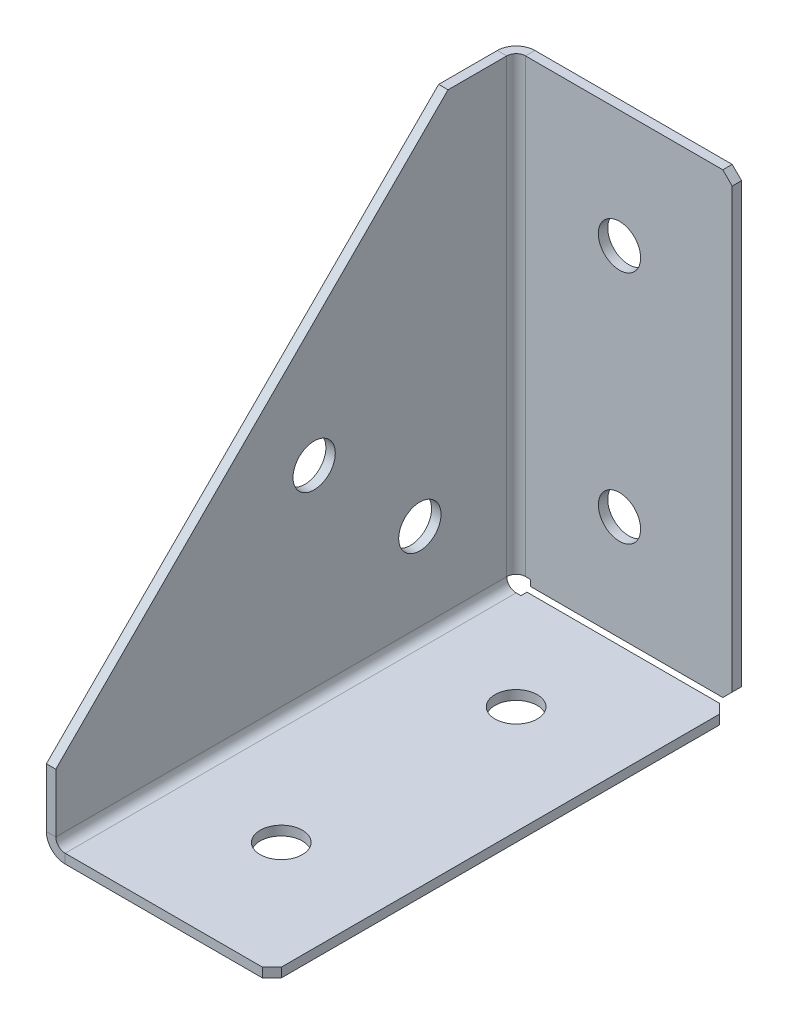
ISO-10303-21;
HEADER;
FILE_DESCRIPTION(('STEP AP214'),'2;1');
FILE_NAME('part.step','',(''),(''),'','','');
FILE_SCHEMA(('AUTOMOTIVE_DESIGN { 1 0 10303 214 1 1 1 1 }'));
ENDSEC;
DATA;
#1=APPLICATION_CONTEXT('core data for automotive mechanical design processes');
#2=APPLICATION_PROTOCOL_DEFINITION('international standard','automotive_design',2000,#1);
#3=PRODUCT_CONTEXT('',#1,'mechanical');
#4=PRODUCT('Part','Part','',(#3));
#5=PRODUCT_RELATED_PRODUCT_CATEGORY('part','',(#4));
#6=PRODUCT_DEFINITION_FORMATION('','',#4);
#7=PRODUCT_DEFINITION_CONTEXT('part definition',#1,'design');
#8=PRODUCT_DEFINITION('design','',#6,#7);
#9=PRODUCT_DEFINITION_SHAPE('','',#8);
#10=(LENGTH_UNIT() NAMED_UNIT(*) SI_UNIT(.MILLI.,.METRE.));
#11=(NAMED_UNIT(*) PLANE_ANGLE_UNIT() SI_UNIT($,.RADIAN.));
#12=(NAMED_UNIT(*) SI_UNIT($,.STERADIAN.) SOLID_ANGLE_UNIT());
#13=UNCERTAINTY_MEASURE_WITH_UNIT(LENGTH_MEASURE(1.E-05),#10,'distance_accuracy_value','');
#14=(GEOMETRIC_REPRESENTATION_CONTEXT(3) GLOBAL_UNCERTAINTY_ASSIGNED_CONTEXT((#13)) GLOBAL_UNIT_ASSIGNED_CONTEXT((#10,
#11,#12)) REPRESENTATION_CONTEXT('',''));
#15=CARTESIAN_POINT('',(0.,0.,0.));
#16=DIRECTION('',(0.,0.,1.));
#17=DIRECTION('',(1.,0.,0.));
#18=AXIS2_PLACEMENT_3D('',#15,#16,#17);
#19=CARTESIAN_POINT('',(4.,4.,3.99999999999998));
#20=DIRECTION('',(0.,0.,1.));
#21=DIRECTION('',(1.,0.,0.));
#22=AXIS2_PLACEMENT_3D('',#19,#20,#21);
#23=PLANE('',#22);
#24=DIRECTION('',(-1.,0.,0.));
#25=VECTOR('',#24,1.);
#26=CARTESIAN_POINT('',(0.,3.99999999999997,3.99999999999997));
#27=LINE('',#26,#25);
#28=CARTESIAN_POINT('',(2.,3.99999999999997,3.99999999999999));
#29=VERTEX_POINT('',#28);
#30=CARTESIAN_POINT('',(0.,3.99999999999997,3.99999999999997));
#31=VERTEX_POINT('',#30);
#32=EDGE_CURVE('E403',#29,#31,#27,.T.);
#33=ORIENTED_EDGE('',*,*,#32,.F.);
#34=CARTESIAN_POINT('',(4.,4.,3.99999999999998));
#35=DIRECTION('',(0.,0.,-1.));
#36=DIRECTION('',(-1.,0.,0.));
#37=AXIS2_PLACEMENT_3D('',#34,#35,#36);
#38=CIRCLE('',#37,2.);
#39=CARTESIAN_POINT('',(4.,2.,3.99999999999998));
#40=VERTEX_POINT('',#39);
#41=EDGE_CURVE('E348',#29,#40,#38,.F.);
#42=ORIENTED_EDGE('',*,*,#41,.T.);
#43=DIRECTION('',(0.,-1.,0.));
#44=VECTOR('',#43,1.);
#45=CARTESIAN_POINT('',(4.,0.,3.99999999999998));
#46=LINE('',#45,#44);
#47=CARTESIAN_POINT('',(4.,0.,3.99999999999998));
#48=VERTEX_POINT('',#47);
#49=EDGE_CURVE('E400',#40,#48,#46,.T.);
#50=ORIENTED_EDGE('',*,*,#49,.T.);
#51=CARTESIAN_POINT('',(4.,4.,3.99999999999998));
#52=DIRECTION('',(0.,0.,-1.));
#53=DIRECTION('',(-1.,0.,0.));
#54=AXIS2_PLACEMENT_3D('',#51,#52,#53);
#55=CIRCLE('',#54,4.);
#56=EDGE_CURVE('E287',#31,#48,#55,.F.);
#57=ORIENTED_EDGE('',*,*,#56,.F.);
#58=EDGE_LOOP('',(#33,#42,#50,#57));
#59=FACE_BOUND('',#58,.T.);
#60=ADVANCED_FACE('F50',(#59),#23,.F.);
#61=CARTESIAN_POINT('',(48.,0.,3.99999999999998));
#62=DIRECTION('',(0.,0.,1.));
#63=DIRECTION('',(1.,0.,0.));
#64=AXIS2_PLACEMENT_3D('',#61,#62,#63);
#65=PLANE('',#64);
#66=ORIENTED_EDGE('',*,*,#49,.F.);
#67=DIRECTION('',(1.,0.,0.));
#68=VECTOR('',#67,1.);
#69=CARTESIAN_POINT('',(48.,2.,3.99999999999998));
#70=LINE('',#69,#68);
#71=CARTESIAN_POINT('',(5.010401,2.,3.99999999999998));
#72=VERTEX_POINT('',#71);
#73=EDGE_CURVE('E318',#40,#72,#70,.T.);
#74=ORIENTED_EDGE('',*,*,#73,.T.);
#75=DIRECTION('',(0.,-1.,0.));
#76=VECTOR('',#75,1.);
#77=CARTESIAN_POINT('',(5.010401,0.,3.99999999999998));
#78=LINE('',#77,#76);
#79=CARTESIAN_POINT('',(5.010401,0.,3.99999999999998));
#80=VERTEX_POINT('',#79);
#81=EDGE_CURVE('E397',#72,#80,#78,.T.);
#82=ORIENTED_EDGE('',*,*,#81,.T.);
#83=DIRECTION('',(1.,0.,0.));
#84=VECTOR('',#83,1.);
#85=CARTESIAN_POINT('',(48.,0.,3.99999999999998));
#86=LINE('',#85,#84);
#87=EDGE_CURVE('E251',#48,#80,#86,.T.);
#88=ORIENTED_EDGE('',*,*,#87,.F.);
#89=EDGE_LOOP('',(#66,#74,#82,#88));
#90=FACE_BOUND('',#89,.T.);
#91=ADVANCED_FACE('F520',(#90),#65,.F.);
#92=CARTESIAN_POINT('',(5.010401,0.,100.));
#93=DIRECTION('',(-1.,0.,0.));
#94=DIRECTION('',(0.,0.,1.));
#95=AXIS2_PLACEMENT_3D('',#92,#93,#94);
#96=PLANE('',#95);
#97=ORIENTED_EDGE('',*,*,#81,.F.);
#98=DIRECTION('',(0.,0.,1.));
#99=VECTOR('',#98,1.);
#100=CARTESIAN_POINT('',(5.010401,2.,100.));
#101=LINE('',#100,#99);
#102=CARTESIAN_POINT('',(5.010401,2.,2.70710678118655));
#103=VERTEX_POINT('',#102);
#104=EDGE_CURVE('E358',#103,#72,#101,.T.);
#105=ORIENTED_EDGE('',*,*,#104,.F.);
#106=DIRECTION('',(0.,-1.,0.));
#107=VECTOR('',#106,1.);
#108=CARTESIAN_POINT('',(5.010401,0.,2.70710678118655));
#109=LINE('',#108,#107);
#110=CARTESIAN_POINT('',(5.010401,0.,2.70710678118655));
#111=VERTEX_POINT('',#110);
#112=EDGE_CURVE('E394',#103,#111,#109,.T.);
#113=ORIENTED_EDGE('',*,*,#112,.T.);
#114=DIRECTION('',(0.,0.,1.));
#115=VECTOR('',#114,1.);
#116=CARTESIAN_POINT('',(5.010401,0.,100.));
#117=LINE('',#116,#115);
#118=EDGE_CURVE('E247',#111,#80,#117,.T.);
#119=ORIENTED_EDGE('',*,*,#118,.T.);
#120=EDGE_LOOP('',(#97,#105,#113,#119));
#121=FACE_BOUND('',#120,.T.);
#122=ADVANCED_FACE('F525',(#121),#96,.T.);
#123=CARTESIAN_POINT('',(48.,0.,2.70710678118655));
#124=DIRECTION('',(0.,0.,1.));
#125=DIRECTION('',(1.,0.,0.));
#126=AXIS2_PLACEMENT_3D('',#123,#124,#125);
#127=PLANE('',#126);
#128=DIRECTION('',(1.,0.,0.));
#129=VECTOR('',#128,1.);
#130=CARTESIAN_POINT('',(48.,2.,2.70710678118655));
#131=LINE('',#130,#129);
#132=CARTESIAN_POINT('',(46.,2.,2.70710678118655));
#133=VERTEX_POINT('',#132);
#134=EDGE_CURVE('E322',#103,#133,#131,.T.);
#135=ORIENTED_EDGE('',*,*,#134,.T.);
#136=DIRECTION('',(0.,1.,0.));
#137=VECTOR('',#136,1.);
#138=CARTESIAN_POINT('',(46.,0.,2.70710678118655));
#139=LINE('',#138,#137);
#140=CARTESIAN_POINT('',(46.,0.,2.70710678118655));
#141=VERTEX_POINT('',#140);
#142=EDGE_CURVE('E430',#133,#141,#139,.F.);
#143=ORIENTED_EDGE('',*,*,#142,.T.);
#144=DIRECTION('',(1.,0.,0.));
#145=VECTOR('',#144,1.);
#146=CARTESIAN_POINT('',(48.,0.,2.70710678118655));
#147=LINE('',#146,#145);
#148=EDGE_CURVE('E243',#111,#141,#147,.T.);
#149=ORIENTED_EDGE('',*,*,#148,.F.);
#150=ORIENTED_EDGE('',*,*,#112,.F.);
#151=EDGE_LOOP('',(#135,#143,#149,#150));
#152=FACE_BOUND('',#151,.T.);
#153=ADVANCED_FACE('F562',(#152),#127,.F.);
#154=CARTESIAN_POINT('',(48.,0.,100.));
#155=DIRECTION('',(1.,0.,0.));
#156=DIRECTION('',(0.,0.,-1.));
#157=AXIS2_PLACEMENT_3D('',#154,#155,#156);
#158=PLANE('',#157);
#159=DIRECTION('',(0.,0.,1.));
#160=VECTOR('',#159,1.);
#161=CARTESIAN_POINT('',(48.,2.,100.));
#162=LINE('',#161,#160);
#163=CARTESIAN_POINT('',(48.,2.,98.));
#164=VERTEX_POINT('',#163);
#165=CARTESIAN_POINT('',(48.,2.,4.70710678118655));
#166=VERTEX_POINT('',#165);
#167=EDGE_CURVE('E351',#164,#166,#162,.F.);
#168=ORIENTED_EDGE('',*,*,#167,.F.);
#169=DIRECTION('',(0.,-1.,0.));
#170=VECTOR('',#169,1.);
#171=CARTESIAN_POINT('',(48.,0.,98.));
#172=LINE('',#171,#170);
#173=CARTESIAN_POINT('',(48.,0.,98.));
#174=VERTEX_POINT('',#173);
#175=EDGE_CURVE('E411',#164,#174,#172,.T.);
#176=ORIENTED_EDGE('',*,*,#175,.T.);
#177=DIRECTION('',(0.,0.,-1.));
#178=VECTOR('',#177,1.);
#179=CARTESIAN_POINT('',(48.,0.,100.));
#180=LINE('',#179,#178);
#181=CARTESIAN_POINT('',(48.,0.,4.70710678118655));
#182=VERTEX_POINT('',#181);
#183=EDGE_CURVE('E280',#174,#182,#180,.T.);
#184=ORIENTED_EDGE('',*,*,#183,.T.);
#185=DIRECTION('',(0.,1.,0.));
#186=VECTOR('',#185,1.);
#187=CARTESIAN_POINT('',(48.,0.,4.70710678118655));
#188=LINE('',#187,#186);
#189=EDGE_CURVE('E406',#182,#166,#188,.T.);
#190=ORIENTED_EDGE('',*,*,#189,.T.);
#191=EDGE_LOOP('',(#168,#176,#184,#190));
#192=FACE_BOUND('',#191,.T.);
#193=ADVANCED_FACE('F576',(#192),#158,.T.);
#194=CARTESIAN_POINT('',(48.,0.,100.));
#195=DIRECTION('',(0.,0.,-1.));
#196=DIRECTION('',(-1.,0.,0.));
#197=AXIS2_PLACEMENT_3D('',#194,#195,#196);
#198=PLANE('',#197);
#199=DIRECTION('',(-1.,0.,0.));
#200=VECTOR('',#199,1.);
#201=CARTESIAN_POINT('',(48.,0.,100.));
#202=LINE('',#201,#200);
#203=CARTESIAN_POINT('',(46.,0.,100.));
#204=VERTEX_POINT('',#203);
#205=CARTESIAN_POINT('',(4.,0.,100.));
#206=VERTEX_POINT('',#205);
#207=EDGE_CURVE('E222',#204,#206,#202,.T.);
#208=ORIENTED_EDGE('',*,*,#207,.F.);
#209=DIRECTION('',(0.,-1.,0.));
#210=VECTOR('',#209,1.);
#211=CARTESIAN_POINT('',(46.,0.,100.));
#212=LINE('',#211,#210);
#213=CARTESIAN_POINT('',(46.,2.,100.));
#214=VERTEX_POINT('',#213);
#215=EDGE_CURVE('E421',#204,#214,#212,.F.);
#216=ORIENTED_EDGE('',*,*,#215,.T.);
#217=DIRECTION('',(1.,0.,0.));
#218=VECTOR('',#217,1.);
#219=CARTESIAN_POINT('',(48.,2.,100.));
#220=LINE('',#219,#218);
#221=CARTESIAN_POINT('',(4.,2.,100.));
#222=VERTEX_POINT('',#221);
#223=EDGE_CURVE('E344',#214,#222,#220,.F.);
#224=ORIENTED_EDGE('',*,*,#223,.T.);
#225=DIRECTION('',(0.,-1.,0.));
#226=VECTOR('',#225,1.);
#227=CARTESIAN_POINT('',(4.,0.,100.));
#228=LINE('',#227,#226);
#229=EDGE_CURVE('E390',#222,#206,#228,.T.);
#230=ORIENTED_EDGE('',*,*,#229,.T.);
#231=EDGE_LOOP('',(#208,#216,#224,#230));
#232=FACE_BOUND('',#231,.T.);
#233=ADVANCED_FACE('F712',(#232),#198,.F.);
#234=CARTESIAN_POINT('',(4.,4.,100.));
#235=DIRECTION('',(0.,0.,1.));
#236=DIRECTION('',(1.,0.,0.));
#237=AXIS2_PLACEMENT_3D('',#234,#235,#236);
#238=PLANE('',#237);
#239=ORIENTED_EDGE('',*,*,#229,.F.);
#240=CARTESIAN_POINT('',(4.,4.,100.));
#241=DIRECTION('',(0.,0.,-1.));
#242=DIRECTION('',(-1.,0.,0.));
#243=AXIS2_PLACEMENT_3D('',#240,#241,#242);
#244=CIRCLE('',#243,2.);
#245=CARTESIAN_POINT('',(2.,4.,100.));
#246=VERTEX_POINT('',#245);
#247=EDGE_CURVE('E335',#222,#246,#244,.T.);
#248=ORIENTED_EDGE('',*,*,#247,.T.);
#249=DIRECTION('',(-1.,0.,0.));
#250=VECTOR('',#249,1.);
#251=CARTESIAN_POINT('',(0.,4.,100.));
#252=LINE('',#251,#250);
#253=CARTESIAN_POINT('',(0.,4.,100.));
#254=VERTEX_POINT('',#253);
#255=EDGE_CURVE('E209',#246,#254,#252,.T.);
#256=ORIENTED_EDGE('',*,*,#255,.T.);
#257=CARTESIAN_POINT('',(4.,4.,100.));
#258=DIRECTION('',(0.,0.,-1.));
#259=DIRECTION('',(-1.,0.,0.));
#260=AXIS2_PLACEMENT_3D('',#257,#258,#259);
#261=CIRCLE('',#260,4.);
#262=EDGE_CURVE('E276',#206,#254,#261,.T.);
#263=ORIENTED_EDGE('',*,*,#262,.F.);
#264=EDGE_LOOP('',(#239,#248,#256,#263));
#265=FACE_BOUND('',#264,.T.);
#266=ADVANCED_FACE('F493',(#265),#238,.T.);
#267=CARTESIAN_POINT('',(0.,16.5,100.));
#268=DIRECTION('',(0.,0.,1.));
#269=DIRECTION('',(0.,-1.,0.));
#270=AXIS2_PLACEMENT_3D('',#267,#268,#269);
#271=PLANE('',#270);
#272=ORIENTED_EDGE('',*,*,#255,.F.);
#273=DIRECTION('',(0.,1.,0.));
#274=VECTOR('',#273,1.);
#275=CARTESIAN_POINT('',(2.,0.,100.));
#276=LINE('',#275,#274);
#277=CARTESIAN_POINT('',(2.,16.5,100.));
#278=VERTEX_POINT('',#277);
#279=EDGE_CURVE('E203',#278,#246,#276,.F.);
#280=ORIENTED_EDGE('',*,*,#279,.F.);
#281=DIRECTION('',(-1.,0.,0.));
#282=VECTOR('',#281,1.);
#283=CARTESIAN_POINT('',(0.,16.5,100.));
#284=LINE('',#283,#282);
#285=CARTESIAN_POINT('',(0.,16.5,100.));
#286=VERTEX_POINT('',#285);
#287=EDGE_CURVE('E197',#278,#286,#284,.T.);
#288=ORIENTED_EDGE('',*,*,#287,.T.);
#289=DIRECTION('',(0.,-1.,0.));
#290=VECTOR('',#289,1.);
#291=CARTESIAN_POINT('',(0.,16.5,100.));
#292=LINE('',#291,#290);
#293=EDGE_CURVE('E200',#286,#254,#292,.T.);
#294=ORIENTED_EDGE('',*,*,#293,.T.);
#295=EDGE_LOOP('',(#272,#280,#288,#294));
#296=FACE_BOUND('',#295,.T.);
#297=ADVANCED_FACE('F199',(#296),#271,.T.);
#298=CARTESIAN_POINT('',(0.,100.,16.5));
#299=DIRECTION('',(0.,0.707106781186548,0.707106781186548));
#300=DIRECTION('',(0.,-0.707106781186547,0.707106781186547));
#301=AXIS2_PLACEMENT_3D('',#298,#299,#300);
#302=PLANE('',#301);
#303=ORIENTED_EDGE('',*,*,#287,.F.);
#304=DIRECTION('',(0.,-0.707106781186547,0.707106781186547));
#305=VECTOR('',#304,1.);
#306=CARTESIAN_POINT('',(2.,100.,16.5));
#307=LINE('',#306,#305);
#308=CARTESIAN_POINT('',(2.,100.,16.5));
#309=VERTEX_POINT('',#308);
#310=EDGE_CURVE('E339',#309,#278,#307,.T.);
#311=ORIENTED_EDGE('',*,*,#310,.F.);
#312=DIRECTION('',(-1.,0.,0.));
#313=VECTOR('',#312,1.);
#314=CARTESIAN_POINT('',(0.,100.,16.5));
#315=LINE('',#314,#313);
#316=CARTESIAN_POINT('',(0.,100.,16.5));
#317=VERTEX_POINT('',#316);
#318=EDGE_CURVE('E210',#309,#317,#315,.T.);
#319=ORIENTED_EDGE('',*,*,#318,.T.);
#320=DIRECTION('',(0.,-0.707106781186547,0.707106781186547));
#321=VECTOR('',#320,1.);
#322=CARTESIAN_POINT('',(0.,100.,16.5));
#323=LINE('',#322,#321);
#324=EDGE_CURVE('E217',#317,#286,#323,.T.);
#325=ORIENTED_EDGE('',*,*,#324,.T.);
#326=EDGE_LOOP('',(#303,#311,#319,#325));
#327=FACE_BOUND('',#326,.T.);
#328=ADVANCED_FACE('F224',(#327),#302,.T.);
#329=CARTESIAN_POINT('',(0.,100.,0.));
#330=DIRECTION('',(0.,1.,0.));
#331=DIRECTION('',(0.,0.,1.));
#332=AXIS2_PLACEMENT_3D('',#329,#330,#331);
#333=PLANE('',#332);
#334=ORIENTED_EDGE('',*,*,#318,.F.);
#335=DIRECTION('',(0.,0.,-1.));
#336=VECTOR('',#335,1.);
#337=CARTESIAN_POINT('',(2.,100.,0.));
#338=LINE('',#337,#336);
#339=CARTESIAN_POINT('',(2.,100.,4.));
#340=VERTEX_POINT('',#339);
#341=EDGE_CURVE('E329',#340,#309,#338,.F.);
#342=ORIENTED_EDGE('',*,*,#341,.F.);
#343=DIRECTION('',(-1.,0.,0.));
#344=VECTOR('',#343,1.);
#345=CARTESIAN_POINT('',(0.,100.,4.));
#346=LINE('',#345,#344);
#347=CARTESIAN_POINT('',(0.,100.,4.));
#348=VERTEX_POINT('',#347);
#349=EDGE_CURVE('E383',#340,#348,#346,.T.);
#350=ORIENTED_EDGE('',*,*,#349,.T.);
#351=DIRECTION('',(0.,0.,1.));
#352=VECTOR('',#351,1.);
#353=CARTESIAN_POINT('',(0.,100.,0.));
#354=LINE('',#353,#352);
#355=EDGE_CURVE('E226',#348,#317,#354,.T.);
#356=ORIENTED_EDGE('',*,*,#355,.T.);
#357=EDGE_LOOP('',(#334,#342,#350,#356));
#358=FACE_BOUND('',#357,.T.);
#359=ADVANCED_FACE('F505',(#358),#333,.T.);
#360=CARTESIAN_POINT('',(4.,100.,4.));
#361=DIRECTION('',(0.,-1.,0.));
#362=DIRECTION('',(0.,0.,-1.));
#363=AXIS2_PLACEMENT_3D('',#360,#361,#362);
#364=PLANE('',#363);
#365=ORIENTED_EDGE('',*,*,#349,.F.);
#366=CARTESIAN_POINT('',(4.,100.,4.));
#367=DIRECTION('',(0.,1.,0.));
#368=DIRECTION('',(0.,0.,1.));
#369=AXIS2_PLACEMENT_3D('',#366,#367,#368);
#370=CIRCLE('',#369,2.);
#371=CARTESIAN_POINT('',(4.,100.,2.));
#372=VERTEX_POINT('',#371);
#373=EDGE_CURVE('E330',#340,#372,#370,.F.);
#374=ORIENTED_EDGE('',*,*,#373,.T.);
#375=DIRECTION('',(0.,0.,-1.));
#376=VECTOR('',#375,1.);
#377=CARTESIAN_POINT('',(4.,100.,0.));
#378=LINE('',#377,#376);
#379=CARTESIAN_POINT('',(4.,100.,0.));
#380=VERTEX_POINT('',#379);
#381=EDGE_CURVE('E379',#372,#380,#378,.T.);
#382=ORIENTED_EDGE('',*,*,#381,.T.);
#383=CARTESIAN_POINT('',(4.,100.,4.));
#384=DIRECTION('',(0.,1.,0.));
#385=DIRECTION('',(0.,0.,1.));
#386=AXIS2_PLACEMENT_3D('',#383,#384,#385);
#387=CIRCLE('',#386,4.);
#388=EDGE_CURVE('E271',#348,#380,#387,.F.);
#389=ORIENTED_EDGE('',*,*,#388,.F.);
#390=EDGE_LOOP('',(#365,#374,#382,#389));
#391=FACE_BOUND('',#390,.T.);
#392=ADVANCED_FACE('F507',(#391),#364,.F.);
#393=CARTESIAN_POINT('',(48.,100.,0.));
#394=DIRECTION('',(0.,1.,0.));
#395=DIRECTION('',(-1.,0.,0.));
#396=AXIS2_PLACEMENT_3D('',#393,#394,#395);
#397=PLANE('',#396);
#398=DIRECTION('',(1.,0.,0.));
#399=VECTOR('',#398,1.);
#400=CARTESIAN_POINT('',(48.,100.,2.));
#401=LINE('',#400,#399);
#402=CARTESIAN_POINT('',(46.,100.,2.));
#403=VERTEX_POINT('',#402);
#404=EDGE_CURVE('E326',#403,#372,#401,.F.);
#405=ORIENTED_EDGE('',*,*,#404,.F.);
#406=DIRECTION('',(0.,0.,-1.));
#407=VECTOR('',#406,1.);
#408=CARTESIAN_POINT('',(46.,100.,0.));
#409=LINE('',#408,#407);
#410=CARTESIAN_POINT('',(46.,100.,0.));
#411=VERTEX_POINT('',#410);
#412=EDGE_CURVE('E11',#403,#411,#409,.T.);
#413=ORIENTED_EDGE('',*,*,#412,.T.);
#414=DIRECTION('',(-1.,0.,0.));
#415=VECTOR('',#414,1.);
#416=CARTESIAN_POINT('',(48.,100.,0.));
#417=LINE('',#416,#415);
#418=EDGE_CURVE('E230',#411,#380,#417,.T.);
#419=ORIENTED_EDGE('',*,*,#418,.T.);
#420=ORIENTED_EDGE('',*,*,#381,.F.);
#421=EDGE_LOOP('',(#405,#413,#419,#420));
#422=FACE_BOUND('',#421,.T.);
#423=ADVANCED_FACE('F511',(#422),#397,.T.);
#424=CARTESIAN_POINT('',(48.,0.,0.));
#425=DIRECTION('',(1.,0.,0.));
#426=DIRECTION('',(0.,1.,0.));
#427=AXIS2_PLACEMENT_3D('',#424,#425,#426);
#428=PLANE('',#427);
#429=DIRECTION('',(0.,1.,0.));
#430=VECTOR('',#429,1.);
#431=CARTESIAN_POINT('',(48.,0.,2.));
#432=LINE('',#431,#430);
#433=CARTESIAN_POINT('',(48.,4.70710678118655,2.));
#434=VERTEX_POINT('',#433);
#435=CARTESIAN_POINT('',(48.,98.,2.));
#436=VERTEX_POINT('',#435);
#437=EDGE_CURVE('E323',#434,#436,#432,.T.);
#438=ORIENTED_EDGE('',*,*,#437,.F.);
#439=DIRECTION('',(0.,0.,-1.));
#440=VECTOR('',#439,1.);
#441=CARTESIAN_POINT('',(48.,4.70710678118655,0.));
#442=LINE('',#441,#440);
#443=CARTESIAN_POINT('',(48.,4.70710678118655,0.));
#444=VERTEX_POINT('',#443);
#445=EDGE_CURVE('E437',#434,#444,#442,.T.);
#446=ORIENTED_EDGE('',*,*,#445,.T.);
#447=DIRECTION('',(0.,1.,0.));
#448=VECTOR('',#447,1.);
#449=CARTESIAN_POINT('',(48.,0.,0.));
#450=LINE('',#449,#448);
#451=CARTESIAN_POINT('',(48.,98.,0.));
#452=VERTEX_POINT('',#451);
#453=EDGE_CURVE('E236',#444,#452,#450,.T.);
#454=ORIENTED_EDGE('',*,*,#453,.T.);
#455=DIRECTION('',(0.,0.,1.));
#456=VECTOR('',#455,1.);
#457=CARTESIAN_POINT('',(48.,98.,0.));
#458=LINE('',#457,#456);
#459=EDGE_CURVE('E434',#452,#436,#458,.T.);
#460=ORIENTED_EDGE('',*,*,#459,.T.);
#461=EDGE_LOOP('',(#438,#446,#454,#460));
#462=FACE_BOUND('',#461,.T.);
#463=ADVANCED_FACE('F458',(#462),#428,.T.);
#464=CARTESIAN_POINT('',(48.,2.70710678118655,0.));
#465=DIRECTION('',(0.,1.,0.));
#466=DIRECTION('',(-1.,0.,0.));
#467=AXIS2_PLACEMENT_3D('',#464,#465,#466);
#468=PLANE('',#467);
#469=DIRECTION('',(-1.,0.,0.));
#470=VECTOR('',#469,1.);
#471=CARTESIAN_POINT('',(48.,2.70710678118655,0.));
#472=LINE('',#471,#470);
#473=CARTESIAN_POINT('',(46.,2.70710678118655,0.));
#474=VERTEX_POINT('',#473);
#475=CARTESIAN_POINT('',(5.010401,2.70710678118655,0.));
#476=VERTEX_POINT('',#475);
#477=EDGE_CURVE('E240',#474,#476,#472,.T.);
#478=ORIENTED_EDGE('',*,*,#477,.F.);
#479=DIRECTION('',(0.,0.,-1.));
#480=VECTOR('',#479,1.);
#481=CARTESIAN_POINT('',(46.,2.70710678118655,0.));
#482=LINE('',#481,#480);
#483=CARTESIAN_POINT('',(46.,2.70710678118655,2.));
#484=VERTEX_POINT('',#483);
#485=EDGE_CURVE('E75',#474,#484,#482,.F.);
#486=ORIENTED_EDGE('',*,*,#485,.T.);
#487=DIRECTION('',(1.,0.,0.));
#488=VECTOR('',#487,1.);
#489=CARTESIAN_POINT('',(48.,2.70710678118655,2.));
#490=LINE('',#489,#488);
#491=CARTESIAN_POINT('',(5.010401,2.70710678118655,2.));
#492=VERTEX_POINT('',#491);
#493=EDGE_CURVE('E319',#484,#492,#490,.F.);
#494=ORIENTED_EDGE('',*,*,#493,.T.);
#495=DIRECTION('',(0.,0.,-1.));
#496=VECTOR('',#495,1.);
#497=CARTESIAN_POINT('',(5.010401,2.70710678118655,0.));
#498=LINE('',#497,#496);
#499=EDGE_CURVE('E375',#492,#476,#498,.T.);
#500=ORIENTED_EDGE('',*,*,#499,.T.);
#501=EDGE_LOOP('',(#478,#486,#494,#500));
#502=FACE_BOUND('',#501,.T.);
#503=ADVANCED_FACE('F465',(#502),#468,.F.);
#504=CARTESIAN_POINT('',(5.010401,0.,0.));
#505=DIRECTION('',(-1.,0.,0.));
#506=DIRECTION('',(0.,-1.,0.));
#507=AXIS2_PLACEMENT_3D('',#504,#505,#506);
#508=PLANE('',#507);
#509=ORIENTED_EDGE('',*,*,#499,.F.);
#510=DIRECTION('',(0.,1.,0.));
#511=VECTOR('',#510,1.);
#512=CARTESIAN_POINT('',(5.010401,0.,2.));
#513=LINE('',#512,#511);
#514=CARTESIAN_POINT('',(5.010401,3.99999999999997,2.));
#515=VERTEX_POINT('',#514);
#516=EDGE_CURVE('E314',#515,#492,#513,.F.);
#517=ORIENTED_EDGE('',*,*,#516,.F.);
#518=DIRECTION('',(0.,0.,-1.));
#519=VECTOR('',#518,1.);
#520=CARTESIAN_POINT('',(5.010401,3.99999999999997,0.));
#521=LINE('',#520,#519);
#522=CARTESIAN_POINT('',(5.010401,3.99999999999997,0.));
#523=VERTEX_POINT('',#522);
#524=EDGE_CURVE('E372',#515,#523,#521,.T.);
#525=ORIENTED_EDGE('',*,*,#524,.T.);
#526=DIRECTION('',(0.,-1.,0.));
#527=VECTOR('',#526,1.);
#528=CARTESIAN_POINT('',(5.010401,0.,0.));
#529=LINE('',#528,#527);
#530=EDGE_CURVE('E255',#523,#476,#529,.T.);
#531=ORIENTED_EDGE('',*,*,#530,.T.);
#532=EDGE_LOOP('',(#509,#517,#525,#531));
#533=FACE_BOUND('',#532,.T.);
#534=ADVANCED_FACE('F469',(#533),#508,.T.);
#535=CARTESIAN_POINT('',(48.,3.99999999999997,0.));
#536=DIRECTION('',(0.,1.,0.));
#537=DIRECTION('',(-1.,0.,0.));
#538=AXIS2_PLACEMENT_3D('',#535,#536,#537);
#539=PLANE('',#538);
#540=ORIENTED_EDGE('',*,*,#524,.F.);
#541=DIRECTION('',(1.,0.,0.));
#542=VECTOR('',#541,1.);
#543=CARTESIAN_POINT('',(48.,3.99999999999997,2.));
#544=LINE('',#543,#542);
#545=CARTESIAN_POINT('',(4.,3.99999999999997,2.));
#546=VERTEX_POINT('',#545);
#547=EDGE_CURVE('E300',#515,#546,#544,.F.);
#548=ORIENTED_EDGE('',*,*,#547,.T.);
#549=DIRECTION('',(0.,0.,-1.));
#550=VECTOR('',#549,1.);
#551=CARTESIAN_POINT('',(4.,3.99999999999997,0.));
#552=LINE('',#551,#550);
#553=CARTESIAN_POINT('',(4.,3.99999999999997,0.));
#554=VERTEX_POINT('',#553);
#555=EDGE_CURVE('E286',#546,#554,#552,.T.);
#556=ORIENTED_EDGE('',*,*,#555,.T.);
#557=DIRECTION('',(-1.,0.,0.));
#558=VECTOR('',#557,1.);
#559=CARTESIAN_POINT('',(48.,3.99999999999997,0.));
#560=LINE('',#559,#558);
#561=EDGE_CURVE('E259',#523,#554,#560,.T.);
#562=ORIENTED_EDGE('',*,*,#561,.F.);
#563=EDGE_LOOP('',(#540,#548,#556,#562));
#564=FACE_BOUND('',#563,.T.);
#565=ADVANCED_FACE('F473',(#564),#539,.F.);
#566=CARTESIAN_POINT('',(4.,3.99999999999997,4.));
#567=DIRECTION('',(0.,1.,0.));
#568=DIRECTION('',(0.,0.,1.));
#569=AXIS2_PLACEMENT_3D('',#566,#567,#568);
#570=PLANE('',#569);
#571=CARTESIAN_POINT('',(4.,3.99999999999997,4.));
#572=DIRECTION('',(0.,1.,0.));
#573=DIRECTION('',(0.,0.,1.));
#574=AXIS2_PLACEMENT_3D('',#571,#572,#573);
#575=CIRCLE('',#574,2.);
#576=EDGE_CURVE('E334',#546,#29,#575,.T.);
#577=ORIENTED_EDGE('',*,*,#576,.T.);
#578=ORIENTED_EDGE('',*,*,#32,.T.);
#579=CARTESIAN_POINT('',(4.,3.99999999999997,4.));
#580=DIRECTION('',(0.,-1.,0.));
#581=DIRECTION('',(0.,0.,-1.));
#582=AXIS2_PLACEMENT_3D('',#579,#580,#581);
#583=CIRCLE('',#582,4.);
#584=EDGE_CURVE('E275',#554,#31,#583,.F.);
#585=ORIENTED_EDGE('',*,*,#584,.F.);
#586=ORIENTED_EDGE('',*,*,#555,.F.);
#587=EDGE_LOOP('',(#577,#578,#585,#586));
#588=FACE_BOUND('',#587,.T.);
#589=ADVANCED_FACE('F478',(#588),#570,.F.);
#590=CARTESIAN_POINT('',(48.,0.,0.));
#591=DIRECTION('',(0.,0.,1.));
#592=DIRECTION('',(1.,0.,0.));
#593=AXIS2_PLACEMENT_3D('',#590,#591,#592);
#594=PLANE('',#593);
#595=CARTESIAN_POINT('',(24.,75.,0.));
#596=DIRECTION('',(0.,0.,1.));
#597=DIRECTION('',(1.,0.,0.));
#598=AXIS2_PLACEMENT_3D('',#595,#596,#597);
#599=CIRCLE('',#598,4.5);
#600=CARTESIAN_POINT('',(28.5,75.,0.));
#601=VERTEX_POINT('',#600);
#602=EDGE_CURVE('E590',#601,#601,#599,.T.);
#603=ORIENTED_EDGE('',*,*,#602,.T.);
#604=EDGE_LOOP('',(#603));
#605=FACE_BOUND('',#604,.T.);
#606=CARTESIAN_POINT('',(24.,25.,0.));
#607=DIRECTION('',(0.,0.,1.));
#608=DIRECTION('',(1.,0.,0.));
#609=AXIS2_PLACEMENT_3D('',#606,#607,#608);
#610=CIRCLE('',#609,4.5);
#611=CARTESIAN_POINT('',(28.5,25.,0.));
#612=VERTEX_POINT('',#611);
#613=EDGE_CURVE('E368',#612,#612,#610,.T.);
#614=ORIENTED_EDGE('',*,*,#613,.T.);
#615=EDGE_LOOP('',(#614));
#616=FACE_BOUND('',#615,.T.);
#617=ORIENTED_EDGE('',*,*,#453,.F.);
#618=DIRECTION('',(-0.70710678118655,-0.707106781186545,0.));
#619=VECTOR('',#618,1.);
#620=CARTESIAN_POINT('',(48.,4.70710678118655,0.));
#621=LINE('',#620,#619);
#622=EDGE_CURVE('E444',#444,#474,#621,.T.);
#623=ORIENTED_EDGE('',*,*,#622,.T.);
#624=ORIENTED_EDGE('',*,*,#477,.T.);
#625=ORIENTED_EDGE('',*,*,#530,.F.);
#626=ORIENTED_EDGE('',*,*,#561,.T.);
#627=DIRECTION('',(0.,1.,0.));
#628=VECTOR('',#627,1.);
#629=CARTESIAN_POINT('',(4.,0.,0.));
#630=LINE('',#629,#628);
#631=EDGE_CURVE('E263',#554,#380,#630,.T.);
#632=ORIENTED_EDGE('',*,*,#631,.T.);
#633=ORIENTED_EDGE('',*,*,#418,.F.);
#634=DIRECTION('',(-0.707106781186545,0.70710678118655,0.));
#635=VECTOR('',#634,1.);
#636=CARTESIAN_POINT('',(46.,100.,0.));
#637=LINE('',#636,#635);
#638=EDGE_CURVE('E441',#411,#452,#637,.F.);
#639=ORIENTED_EDGE('',*,*,#638,.T.);
#640=EDGE_LOOP('',(#617,#623,#624,#625,#626,#632,#633,#639));
#641=FACE_BOUND('',#640,.T.);
#642=ADVANCED_FACE('F463',(#605,#616,#641),#594,.F.);
#643=CARTESIAN_POINT('',(0.,0.,0.));
#644=DIRECTION('',(1.,0.,0.));
#645=DIRECTION('',(0.,0.,-1.));
#646=AXIS2_PLACEMENT_3D('',#643,#644,#645);
#647=PLANE('',#646);
#648=CARTESIAN_POINT('',(0.,45.,45.));
#649=DIRECTION('',(1.,0.,0.));
#650=DIRECTION('',(0.,0.,-1.));
#651=AXIS2_PLACEMENT_3D('',#648,#649,#650);
#652=CIRCLE('',#651,4.5);
#653=CARTESIAN_POINT('',(0.,45.,40.5));
#654=VERTEX_POINT('',#653);
#655=EDGE_CURVE('E619',#654,#654,#652,.T.);
#656=ORIENTED_EDGE('',*,*,#655,.T.);
#657=EDGE_LOOP('',(#656));
#658=FACE_BOUND('',#657,.T.);
#659=CARTESIAN_POINT('',(0.,22.5,22.5));
#660=DIRECTION('',(1.,0.,0.));
#661=DIRECTION('',(0.,0.,-1.));
#662=AXIS2_PLACEMENT_3D('',#659,#660,#661);
#663=CIRCLE('',#662,4.5);
#664=CARTESIAN_POINT('',(0.,22.5,18.));
#665=VERTEX_POINT('',#664);
#666=EDGE_CURVE('E614',#665,#665,#663,.T.);
#667=ORIENTED_EDGE('',*,*,#666,.T.);
#668=EDGE_LOOP('',(#667));
#669=FACE_BOUND('',#668,.T.);
#670=DIRECTION('',(0.,1.,0.));
#671=VECTOR('',#670,1.);
#672=CARTESIAN_POINT('',(0.,0.,4.));
#673=LINE('',#672,#671);
#674=EDGE_CURVE('E267',#348,#31,#673,.F.);
#675=ORIENTED_EDGE('',*,*,#674,.T.);
#676=DIRECTION('',(0.,0.,-1.));
#677=VECTOR('',#676,1.);
#678=CARTESIAN_POINT('',(0.,4.,0.));
#679=LINE('',#678,#677);
#680=EDGE_CURVE('E220',#31,#254,#679,.F.);
#681=ORIENTED_EDGE('',*,*,#680,.T.);
#682=ORIENTED_EDGE('',*,*,#293,.F.);
#683=ORIENTED_EDGE('',*,*,#324,.F.);
#684=ORIENTED_EDGE('',*,*,#355,.F.);
#685=EDGE_LOOP('',(#675,#681,#682,#683,#684));
#686=FACE_BOUND('',#685,.T.);
#687=ADVANCED_FACE('F215',(#658,#669,#686),#647,.F.);
#688=CARTESIAN_POINT('',(48.,0.,100.));
#689=DIRECTION('',(0.,1.,0.));
#690=DIRECTION('',(0.,0.,1.));
#691=AXIS2_PLACEMENT_3D('',#688,#689,#690);
#692=PLANE('',#691);
#693=CARTESIAN_POINT('',(25.,0.,75.));
#694=DIRECTION('',(0.,1.,0.));
#695=DIRECTION('',(0.,0.,1.));
#696=AXIS2_PLACEMENT_3D('',#693,#694,#695);
#697=CIRCLE('',#696,4.5);
#698=CARTESIAN_POINT('',(25.,0.,79.5));
#699=VERTEX_POINT('',#698);
#700=EDGE_CURVE('E606',#699,#699,#697,.T.);
#701=ORIENTED_EDGE('',*,*,#700,.T.);
#702=EDGE_LOOP('',(#701));
#703=FACE_BOUND('',#702,.T.);
#704=CARTESIAN_POINT('',(25.,0.,25.));
#705=DIRECTION('',(0.,1.,0.));
#706=DIRECTION('',(0.,0.,1.));
#707=AXIS2_PLACEMENT_3D('',#704,#705,#706);
#708=CIRCLE('',#707,4.5);
#709=CARTESIAN_POINT('',(25.,0.,29.5));
#710=VERTEX_POINT('',#709);
#711=EDGE_CURVE('E598',#710,#710,#708,.T.);
#712=ORIENTED_EDGE('',*,*,#711,.T.);
#713=EDGE_LOOP('',(#712));
#714=FACE_BOUND('',#713,.T.);
#715=ORIENTED_EDGE('',*,*,#183,.F.);
#716=DIRECTION('',(-0.707106781186552,0.,0.707106781186543));
#717=VECTOR('',#716,1.);
#718=CARTESIAN_POINT('',(48.,0.,98.));
#719=LINE('',#718,#717);
#720=EDGE_CURVE('E418',#174,#204,#719,.T.);
#721=ORIENTED_EDGE('',*,*,#720,.T.);
#722=ORIENTED_EDGE('',*,*,#207,.T.);
#723=DIRECTION('',(0.,0.,-1.));
#724=VECTOR('',#723,1.);
#725=CARTESIAN_POINT('',(4.,0.,100.));
#726=LINE('',#725,#724);
#727=EDGE_CURVE('E270',#206,#48,#726,.T.);
#728=ORIENTED_EDGE('',*,*,#727,.T.);
#729=ORIENTED_EDGE('',*,*,#87,.T.);
#730=ORIENTED_EDGE('',*,*,#118,.F.);
#731=ORIENTED_EDGE('',*,*,#148,.T.);
#732=DIRECTION('',(0.707106781186545,0.,0.70710678118655));
#733=VECTOR('',#732,1.);
#734=CARTESIAN_POINT('',(46.,0.,2.70710678118655));
#735=LINE('',#734,#733);
#736=EDGE_CURVE('E415',#141,#182,#735,.T.);
#737=ORIENTED_EDGE('',*,*,#736,.T.);
#738=EDGE_LOOP('',(#715,#721,#722,#728,#729,#730,#731,#737));
#739=FACE_BOUND('',#738,.T.);
#740=ADVANCED_FACE('F568',(#703,#714,#739),#692,.F.);
#741=CARTESIAN_POINT('',(4.,0.,4.));
#742=DIRECTION('',(0.,1.,0.));
#743=DIRECTION('',(0.,0.,1.));
#744=AXIS2_PLACEMENT_3D('',#741,#742,#743);
#745=CYLINDRICAL_SURFACE('',#744,4.);
#746=ORIENTED_EDGE('',*,*,#584,.T.);
#747=ORIENTED_EDGE('',*,*,#674,.F.);
#748=ORIENTED_EDGE('',*,*,#388,.T.);
#749=ORIENTED_EDGE('',*,*,#631,.F.);
#750=EDGE_LOOP('',(#746,#747,#748,#749));
#751=FACE_BOUND('',#750,.T.);
#752=ADVANCED_FACE('F482',(#751),#745,.T.);
#753=CARTESIAN_POINT('',(4.,4.,100.));
#754=DIRECTION('',(0.,0.,-1.));
#755=DIRECTION('',(-1.,0.,0.));
#756=AXIS2_PLACEMENT_3D('',#753,#754,#755);
#757=CYLINDRICAL_SURFACE('',#756,4.);
#758=ORIENTED_EDGE('',*,*,#262,.T.);
#759=ORIENTED_EDGE('',*,*,#680,.F.);
#760=ORIENTED_EDGE('',*,*,#56,.T.);
#761=ORIENTED_EDGE('',*,*,#727,.F.);
#762=EDGE_LOOP('',(#758,#759,#760,#761));
#763=FACE_BOUND('',#762,.T.);
#764=ADVANCED_FACE('F489',(#763),#757,.T.);
#765=CARTESIAN_POINT('',(48.,0.,2.));
#766=DIRECTION('',(0.,0.,1.));
#767=DIRECTION('',(1.,0.,0.));
#768=AXIS2_PLACEMENT_3D('',#765,#766,#767);
#769=PLANE('',#768);
#770=CARTESIAN_POINT('',(24.,75.,2.));
#771=DIRECTION('',(0.,0.,1.));
#772=DIRECTION('',(1.,0.,0.));
#773=AXIS2_PLACEMENT_3D('',#770,#771,#772);
#774=CIRCLE('',#773,4.5);
#775=CARTESIAN_POINT('',(28.5,75.,2.));
#776=VERTEX_POINT('',#775);
#777=EDGE_CURVE('E594',#776,#776,#774,.T.);
#778=ORIENTED_EDGE('',*,*,#777,.F.);
#779=EDGE_LOOP('',(#778));
#780=FACE_BOUND('',#779,.T.);
#781=CARTESIAN_POINT('',(24.,25.,2.));
#782=DIRECTION('',(0.,0.,1.));
#783=DIRECTION('',(1.,0.,0.));
#784=AXIS2_PLACEMENT_3D('',#781,#782,#783);
#785=CIRCLE('',#784,4.5);
#786=CARTESIAN_POINT('',(28.5,25.,2.));
#787=VERTEX_POINT('',#786);
#788=EDGE_CURVE('E586',#787,#787,#785,.T.);
#789=ORIENTED_EDGE('',*,*,#788,.F.);
#790=EDGE_LOOP('',(#789));
#791=FACE_BOUND('',#790,.T.);
#792=ORIENTED_EDGE('',*,*,#493,.F.);
#793=DIRECTION('',(0.70710678118655,0.707106781186545,0.));
#794=VECTOR('',#793,1.);
#795=CARTESIAN_POINT('',(45.6464466094067,2.35355339059329,2.));
#796=LINE('',#795,#794);
#797=EDGE_CURVE('E60',#484,#434,#796,.T.);
#798=ORIENTED_EDGE('',*,*,#797,.T.);
#799=ORIENTED_EDGE('',*,*,#437,.T.);
#800=DIRECTION('',(0.707106781186545,-0.70710678118655,0.));
#801=VECTOR('',#800,1.);
#802=CARTESIAN_POINT('',(97.,48.9999999999997,2.));
#803=LINE('',#802,#801);
#804=EDGE_CURVE('E67',#436,#403,#803,.F.);
#805=ORIENTED_EDGE('',*,*,#804,.T.);
#806=ORIENTED_EDGE('',*,*,#404,.T.);
#807=DIRECTION('',(0.,1.,0.));
#808=VECTOR('',#807,1.);
#809=CARTESIAN_POINT('',(4.,0.,2.));
#810=LINE('',#809,#808);
#811=EDGE_CURVE('E295',#546,#372,#810,.T.);
#812=ORIENTED_EDGE('',*,*,#811,.F.);
#813=ORIENTED_EDGE('',*,*,#547,.F.);
#814=ORIENTED_EDGE('',*,*,#516,.T.);
#815=EDGE_LOOP('',(#792,#798,#799,#805,#806,#812,#813,#814));
#816=FACE_BOUND('',#815,.T.);
#817=ADVANCED_FACE('F454',(#780,#791,#816),#769,.T.);
#818=CARTESIAN_POINT('',(2.,0.,0.));
#819=DIRECTION('',(1.,0.,0.));
#820=DIRECTION('',(0.,0.,-1.));
#821=AXIS2_PLACEMENT_3D('',#818,#819,#820);
#822=PLANE('',#821);
#823=CARTESIAN_POINT('',(2.,45.,45.));
#824=DIRECTION('',(1.,0.,0.));
#825=DIRECTION('',(0.,0.,-1.));
#826=AXIS2_PLACEMENT_3D('',#823,#824,#825);
#827=CIRCLE('',#826,4.5);
#828=CARTESIAN_POINT('',(2.,45.,40.5));
#829=VERTEX_POINT('',#828);
#830=EDGE_CURVE('E623',#829,#829,#827,.T.);
#831=ORIENTED_EDGE('',*,*,#830,.F.);
#832=EDGE_LOOP('',(#831));
#833=FACE_BOUND('',#832,.T.);
#834=CARTESIAN_POINT('',(2.,22.5,22.5));
#835=DIRECTION('',(1.,0.,0.));
#836=DIRECTION('',(0.,0.,-1.));
#837=AXIS2_PLACEMENT_3D('',#834,#835,#836);
#838=CIRCLE('',#837,4.5);
#839=CARTESIAN_POINT('',(2.,22.5,18.));
#840=VERTEX_POINT('',#839);
#841=EDGE_CURVE('E615',#840,#840,#838,.T.);
#842=ORIENTED_EDGE('',*,*,#841,.F.);
#843=EDGE_LOOP('',(#842));
#844=FACE_BOUND('',#843,.T.);
#845=DIRECTION('',(0.,1.,0.));
#846=VECTOR('',#845,1.);
#847=CARTESIAN_POINT('',(2.,0.,4.));
#848=LINE('',#847,#846);
#849=EDGE_CURVE('E299',#340,#29,#848,.F.);
#850=ORIENTED_EDGE('',*,*,#849,.F.);
#851=ORIENTED_EDGE('',*,*,#341,.T.);
#852=ORIENTED_EDGE('',*,*,#310,.T.);
#853=ORIENTED_EDGE('',*,*,#279,.T.);
#854=DIRECTION('',(0.,0.,-1.));
#855=VECTOR('',#854,1.);
#856=CARTESIAN_POINT('',(2.,3.99999999999997,0.));
#857=LINE('',#856,#855);
#858=EDGE_CURVE('E291',#29,#246,#857,.F.);
#859=ORIENTED_EDGE('',*,*,#858,.F.);
#860=EDGE_LOOP('',(#850,#851,#852,#853,#859));
#861=FACE_BOUND('',#860,.T.);
#862=ADVANCED_FACE('F501',(#833,#844,#861),#822,.T.);
#863=CARTESIAN_POINT('',(48.,2.,100.));
#864=DIRECTION('',(0.,1.,0.));
#865=DIRECTION('',(0.,0.,1.));
#866=AXIS2_PLACEMENT_3D('',#863,#864,#865);
#867=PLANE('',#866);
#868=CARTESIAN_POINT('',(25.,2.,75.));
#869=DIRECTION('',(0.,1.,0.));
#870=DIRECTION('',(0.,0.,1.));
#871=AXIS2_PLACEMENT_3D('',#868,#869,#870);
#872=CIRCLE('',#871,4.5);
#873=CARTESIAN_POINT('',(25.,2.,79.5));
#874=VERTEX_POINT('',#873);
#875=EDGE_CURVE('E610',#874,#874,#872,.T.);
#876=ORIENTED_EDGE('',*,*,#875,.F.);
#877=EDGE_LOOP('',(#876));
#878=FACE_BOUND('',#877,.T.);
#879=CARTESIAN_POINT('',(25.,2.,25.));
#880=DIRECTION('',(0.,1.,0.));
#881=DIRECTION('',(0.,0.,1.));
#882=AXIS2_PLACEMENT_3D('',#879,#880,#881);
#883=CIRCLE('',#882,4.5);
#884=CARTESIAN_POINT('',(25.,2.,29.5));
#885=VERTEX_POINT('',#884);
#886=EDGE_CURVE('E602',#885,#885,#883,.T.);
#887=ORIENTED_EDGE('',*,*,#886,.F.);
#888=EDGE_LOOP('',(#887));
#889=FACE_BOUND('',#888,.T.);
#890=ORIENTED_EDGE('',*,*,#223,.F.);
#891=DIRECTION('',(0.707106781186552,0.,-0.707106781186543));
#892=VECTOR('',#891,1.);
#893=CARTESIAN_POINT('',(47.,2.,99.));
#894=LINE('',#893,#892);
#895=EDGE_CURVE('E427',#214,#164,#894,.T.);
#896=ORIENTED_EDGE('',*,*,#895,.T.);
#897=ORIENTED_EDGE('',*,*,#167,.T.);
#898=DIRECTION('',(-0.707106781186545,0.,-0.70710678118655));
#899=VECTOR('',#898,1.);
#900=CARTESIAN_POINT('',(95.6464466094067,2.,52.3535533905936));
#901=LINE('',#900,#899);
#902=EDGE_CURVE('E424',#166,#133,#901,.T.);
#903=ORIENTED_EDGE('',*,*,#902,.T.);
#904=ORIENTED_EDGE('',*,*,#134,.F.);
#905=ORIENTED_EDGE('',*,*,#104,.T.);
#906=ORIENTED_EDGE('',*,*,#73,.F.);
#907=DIRECTION('',(0.,0.,1.));
#908=VECTOR('',#907,1.);
#909=CARTESIAN_POINT('',(4.,2.,100.));
#910=LINE('',#909,#908);
#911=EDGE_CURVE('E304',#222,#40,#910,.F.);
#912=ORIENTED_EDGE('',*,*,#911,.F.);
#913=EDGE_LOOP('',(#890,#896,#897,#903,#904,#905,#906,#912));
#914=FACE_BOUND('',#913,.T.);
#915=ADVANCED_FACE('F558',(#878,#889,#914),#867,.T.);
#916=CARTESIAN_POINT('',(4.,0.,4.));
#917=DIRECTION('',(0.,1.,0.));
#918=DIRECTION('',(0.,0.,1.));
#919=AXIS2_PLACEMENT_3D('',#916,#917,#918);
#920=CYLINDRICAL_SURFACE('',#919,2.);
#921=ORIENTED_EDGE('',*,*,#576,.F.);
#922=ORIENTED_EDGE('',*,*,#811,.T.);
#923=ORIENTED_EDGE('',*,*,#373,.F.);
#924=ORIENTED_EDGE('',*,*,#849,.T.);
#925=EDGE_LOOP('',(#921,#922,#923,#924));
#926=FACE_BOUND('',#925,.T.);
#927=ADVANCED_FACE('F685',(#926),#920,.F.);
#928=CARTESIAN_POINT('',(4.,4.,100.));
#929=DIRECTION('',(0.,0.,-1.));
#930=DIRECTION('',(-1.,0.,0.));
#931=AXIS2_PLACEMENT_3D('',#928,#929,#930);
#932=CYLINDRICAL_SURFACE('',#931,2.);
#933=ORIENTED_EDGE('',*,*,#247,.F.);
#934=ORIENTED_EDGE('',*,*,#911,.T.);
#935=ORIENTED_EDGE('',*,*,#41,.F.);
#936=ORIENTED_EDGE('',*,*,#858,.T.);
#937=EDGE_LOOP('',(#933,#934,#935,#936));
#938=FACE_BOUND('',#937,.T.);
#939=ADVANCED_FACE('F498',(#938),#932,.F.);
#940=CARTESIAN_POINT('',(24.,25.,2.));
#941=DIRECTION('',(0.,0.,1.));
#942=DIRECTION('',(1.,0.,0.));
#943=AXIS2_PLACEMENT_3D('',#940,#941,#942);
#944=CYLINDRICAL_SURFACE('',#943,4.5);
#945=ORIENTED_EDGE('',*,*,#613,.F.);
#946=EDGE_LOOP('',(#945));
#947=FACE_BOUND('',#946,.T.);
#948=ORIENTED_EDGE('',*,*,#788,.T.);
#949=EDGE_LOOP('',(#948));
#950=FACE_BOUND('',#949,.T.);
#951=ADVANCED_FACE('F663',(#947,#950),#944,.F.);
#952=CARTESIAN_POINT('',(24.,75.,2.));
#953=DIRECTION('',(0.,0.,1.));
#954=DIRECTION('',(1.,0.,0.));
#955=AXIS2_PLACEMENT_3D('',#952,#953,#954);
#956=CYLINDRICAL_SURFACE('',#955,4.5);
#957=ORIENTED_EDGE('',*,*,#602,.F.);
#958=EDGE_LOOP('',(#957));
#959=FACE_BOUND('',#958,.T.);
#960=ORIENTED_EDGE('',*,*,#777,.T.);
#961=EDGE_LOOP('',(#960));
#962=FACE_BOUND('',#961,.T.);
#963=ADVANCED_FACE('F659',(#959,#962),#956,.F.);
#964=CARTESIAN_POINT('',(25.,2.,25.));
#965=DIRECTION('',(0.,1.,0.));
#966=DIRECTION('',(0.,0.,1.));
#967=AXIS2_PLACEMENT_3D('',#964,#965,#966);
#968=CYLINDRICAL_SURFACE('',#967,4.5);
#969=ORIENTED_EDGE('',*,*,#711,.F.);
#970=EDGE_LOOP('',(#969));
#971=FACE_BOUND('',#970,.T.);
#972=ORIENTED_EDGE('',*,*,#886,.T.);
#973=EDGE_LOOP('',(#972));
#974=FACE_BOUND('',#973,.T.);
#975=ADVANCED_FACE('F652',(#971,#974),#968,.F.);
#976=CARTESIAN_POINT('',(25.,2.,75.));
#977=DIRECTION('',(0.,1.,0.));
#978=DIRECTION('',(0.,0.,1.));
#979=AXIS2_PLACEMENT_3D('',#976,#977,#978);
#980=CYLINDRICAL_SURFACE('',#979,4.5);
#981=ORIENTED_EDGE('',*,*,#700,.F.);
#982=EDGE_LOOP('',(#981));
#983=FACE_BOUND('',#982,.T.);
#984=ORIENTED_EDGE('',*,*,#875,.T.);
#985=EDGE_LOOP('',(#984));
#986=FACE_BOUND('',#985,.T.);
#987=ADVANCED_FACE('F646',(#983,#986),#980,.F.);
#988=CARTESIAN_POINT('',(0.,22.5,22.5));
#989=DIRECTION('',(1.,0.,0.));
#990=DIRECTION('',(0.,0.,-1.));
#991=AXIS2_PLACEMENT_3D('',#988,#989,#990);
#992=CYLINDRICAL_SURFACE('',#991,4.5);
#993=ORIENTED_EDGE('',*,*,#666,.F.);
#994=EDGE_LOOP('',(#993));
#995=FACE_BOUND('',#994,.T.);
#996=ORIENTED_EDGE('',*,*,#841,.T.);
#997=EDGE_LOOP('',(#996));
#998=FACE_BOUND('',#997,.T.);
#999=ADVANCED_FACE('F636',(#995,#998),#992,.F.);
#1000=CARTESIAN_POINT('',(0.,45.,45.));
#1001=DIRECTION('',(1.,0.,0.));
#1002=DIRECTION('',(0.,0.,-1.));
#1003=AXIS2_PLACEMENT_3D('',#1000,#1001,#1002);
#1004=CYLINDRICAL_SURFACE('',#1003,4.5);
#1005=ORIENTED_EDGE('',*,*,#655,.F.);
#1006=EDGE_LOOP('',(#1005));
#1007=FACE_BOUND('',#1006,.T.);
#1008=ORIENTED_EDGE('',*,*,#830,.T.);
#1009=EDGE_LOOP('',(#1008));
#1010=FACE_BOUND('',#1009,.T.);
#1011=ADVANCED_FACE('F539',(#1007,#1010),#1004,.F.);
#1012=CARTESIAN_POINT('',(48.,0.,98.));
#1013=DIRECTION('',(0.707106781186542,0.,0.707106781186552));
#1014=DIRECTION('',(0.,1.,0.));
#1015=AXIS2_PLACEMENT_3D('',#1012,#1013,#1014);
#1016=PLANE('',#1015);
#1017=ORIENTED_EDGE('',*,*,#895,.F.);
#1018=ORIENTED_EDGE('',*,*,#215,.F.);
#1019=ORIENTED_EDGE('',*,*,#720,.F.);
#1020=ORIENTED_EDGE('',*,*,#175,.F.);
#1021=EDGE_LOOP('',(#1017,#1018,#1019,#1020));
#1022=FACE_BOUND('',#1021,.T.);
#1023=ADVANCED_FACE('F533',(#1022),#1016,.T.);
#1024=CARTESIAN_POINT('',(46.,0.,2.70710678118655));
#1025=DIRECTION('',(0.70710678118655,0.,-0.707106781186545));
#1026=DIRECTION('',(0.,1.,0.));
#1027=AXIS2_PLACEMENT_3D('',#1024,#1025,#1026);
#1028=PLANE('',#1027);
#1029=ORIENTED_EDGE('',*,*,#902,.F.);
#1030=ORIENTED_EDGE('',*,*,#189,.F.);
#1031=ORIENTED_EDGE('',*,*,#736,.F.);
#1032=ORIENTED_EDGE('',*,*,#142,.F.);
#1033=EDGE_LOOP('',(#1029,#1030,#1031,#1032));
#1034=FACE_BOUND('',#1033,.T.);
#1035=ADVANCED_FACE('F518',(#1034),#1028,.T.);
#1036=CARTESIAN_POINT('',(48.,4.70710678118655,0.));
#1037=DIRECTION('',(0.707106781186545,-0.70710678118655,0.));
#1038=DIRECTION('',(0.,0.,1.));
#1039=AXIS2_PLACEMENT_3D('',#1036,#1037,#1038);
#1040=PLANE('',#1039);
#1041=ORIENTED_EDGE('',*,*,#797,.F.);
#1042=ORIENTED_EDGE('',*,*,#485,.F.);
#1043=ORIENTED_EDGE('',*,*,#622,.F.);
#1044=ORIENTED_EDGE('',*,*,#445,.F.);
#1045=EDGE_LOOP('',(#1041,#1042,#1043,#1044));
#1046=FACE_BOUND('',#1045,.T.);
#1047=ADVANCED_FACE('F461',(#1046),#1040,.T.);
#1048=CARTESIAN_POINT('',(46.,100.,0.));
#1049=DIRECTION('',(-0.70710678118655,-0.707106781186545,0.));
#1050=DIRECTION('',(0.,0.,-1.));
#1051=AXIS2_PLACEMENT_3D('',#1048,#1049,#1050);
#1052=PLANE('',#1051);
#1053=ORIENTED_EDGE('',*,*,#804,.F.);
#1054=ORIENTED_EDGE('',*,*,#459,.F.);
#1055=ORIENTED_EDGE('',*,*,#638,.F.);
#1056=ORIENTED_EDGE('',*,*,#412,.F.);
#1057=EDGE_LOOP('',(#1053,#1054,#1055,#1056));
#1058=FACE_BOUND('',#1057,.T.);
#1059=ADVANCED_FACE('F53',(#1058),#1052,.F.);
#1060=CLOSED_SHELL('',(#60,#91,#122,#153,#193,#233,#266,#297,#328,#359,#392,#423,#463,#503,#534,
#565,#589,#642,#687,#740,#752,#764,#817,#862,#915,#927,#939,#951,#963,#975,#987,#999,#1011,
#1023,#1035,#1047,#1059));
#1061=MANIFOLD_SOLID_BREP('B2',#1060);
#1062=ADVANCED_BREP_SHAPE_REPRESENTATION('',(#18,#1061),#14);
#1063=SHAPE_DEFINITION_REPRESENTATION(#9,#1062);
ENDSEC;
END-ISO-10303-21;
